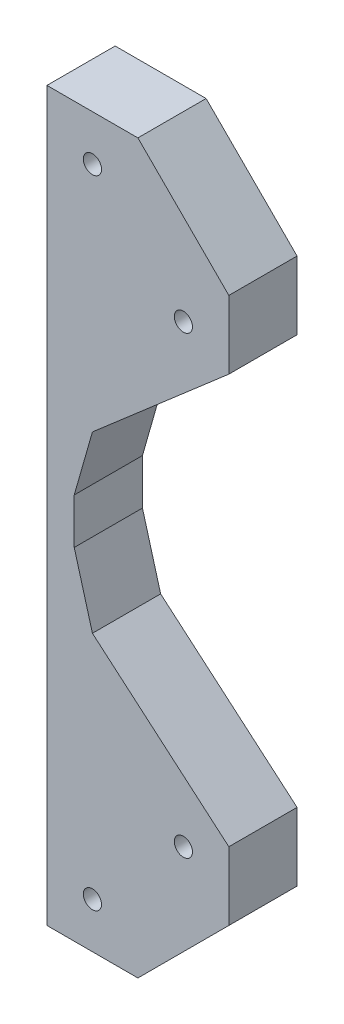
ISO-10303-21;
HEADER;
FILE_DESCRIPTION(('STEP AP214'),'2;1');
FILE_NAME('part.step','',(''),(''),'','','');
FILE_SCHEMA(('AUTOMOTIVE_DESIGN { 1 0 10303 214 1 1 1 1 }'));
ENDSEC;
DATA;
#1=APPLICATION_CONTEXT('core data for automotive mechanical design processes');
#2=APPLICATION_PROTOCOL_DEFINITION('international standard','automotive_design',2000,#1);
#3=PRODUCT_CONTEXT('',#1,'mechanical');
#4=PRODUCT('Part','Part','',(#3));
#5=PRODUCT_RELATED_PRODUCT_CATEGORY('part','',(#4));
#6=PRODUCT_DEFINITION_FORMATION('','',#4);
#7=PRODUCT_DEFINITION_CONTEXT('part definition',#1,'design');
#8=PRODUCT_DEFINITION('design','',#6,#7);
#9=PRODUCT_DEFINITION_SHAPE('','',#8);
#10=(LENGTH_UNIT() NAMED_UNIT(*) SI_UNIT(.MILLI.,.METRE.));
#11=(NAMED_UNIT(*) PLANE_ANGLE_UNIT() SI_UNIT($,.RADIAN.));
#12=(NAMED_UNIT(*) SI_UNIT($,.STERADIAN.) SOLID_ANGLE_UNIT());
#13=UNCERTAINTY_MEASURE_WITH_UNIT(LENGTH_MEASURE(1.E-05),#10,'distance_accuracy_value','');
#14=(GEOMETRIC_REPRESENTATION_CONTEXT(3) GLOBAL_UNCERTAINTY_ASSIGNED_CONTEXT((#13)) GLOBAL_UNIT_ASSIGNED_CONTEXT((#10,
#11,#12)) REPRESENTATION_CONTEXT('',''));
#15=CARTESIAN_POINT('',(0.,0.,0.));
#16=DIRECTION('',(0.,0.,1.));
#17=DIRECTION('',(1.,0.,0.));
#18=AXIS2_PLACEMENT_3D('',#15,#16,#17);
#19=CARTESIAN_POINT('',(0.,0.,15.));
#20=DIRECTION('',(0.,0.,-1.));
#21=DIRECTION('',(-1.,0.,0.));
#22=AXIS2_PLACEMENT_3D('',#19,#20,#21);
#23=PLANE('',#22);
#24=DIRECTION('',(0.,-1.,0.));
#25=VECTOR('',#24,1.);
#26=CARTESIAN_POINT('',(0.,-74.9247201383113,15.));
#27=LINE('',#26,#25);
#28=CARTESIAN_POINT('',(0.,85.0752762854099,15.));
#29=VERTEX_POINT('',#28);
#30=CARTESIAN_POINT('',(0.,-74.9247201383113,15.));
#31=VERTEX_POINT('',#30);
#32=EDGE_CURVE('E180',#29,#31,#27,.T.);
#33=ORIENTED_EDGE('',*,*,#32,.T.);
#34=DIRECTION('',(1.,0.,0.));
#35=VECTOR('',#34,1.);
#36=CARTESIAN_POINT('',(19.9999995529652,-74.9247201383113,15.));
#37=LINE('',#36,#35);
#38=CARTESIAN_POINT('',(19.9999995529652,-74.9247201383113,15.));
#39=VERTEX_POINT('',#38);
#40=EDGE_CURVE('E108',#31,#39,#37,.T.);
#41=ORIENTED_EDGE('',*,*,#40,.T.);
#42=DIRECTION('',(0.707106781186547,0.707106781186548,0.));
#43=VECTOR('',#42,1.);
#44=CARTESIAN_POINT('',(19.9999995529652,-74.9247201383113,15.));
#45=LINE('',#44,#43);
#46=CARTESIAN_POINT('',(39.9999991059303,-54.9247205853461,15.));
#47=VERTEX_POINT('',#46);
#48=EDGE_CURVE('E207',#39,#47,#45,.T.);
#49=ORIENTED_EDGE('',*,*,#48,.T.);
#50=DIRECTION('',(0.,1.,0.));
#51=VECTOR('',#50,1.);
#52=CARTESIAN_POINT('',(39.9999991059303,-39.9252750575542,15.));
#53=LINE('',#52,#51);
#54=CARTESIAN_POINT('',(39.9999991059303,-39.9252750575542,15.));
#55=VERTEX_POINT('',#54);
#56=EDGE_CURVE('E226',#47,#55,#53,.T.);
#57=ORIENTED_EDGE('',*,*,#56,.T.);
#58=DIRECTION('',(-0.760020948334788,0.649898575234851,0.));
#59=VECTOR('',#58,1.);
#60=CARTESIAN_POINT('',(9.99999977648258,-14.2720915973186,15.));
#61=LINE('',#60,#59);
#62=CARTESIAN_POINT('',(9.99999977648258,-14.2720915973186,15.));
#63=VERTEX_POINT('',#62);
#64=EDGE_CURVE('E223',#55,#63,#61,.T.);
#65=ORIENTED_EDGE('',*,*,#64,.T.);
#66=DIRECTION('',(-0.268559788040343,0.963263017170143,0.));
#67=VECTOR('',#66,1.);
#68=CARTESIAN_POINT('',(6.00000005215407,0.0749997198581306,15.));
#69=LINE('',#68,#67);
#70=CARTESIAN_POINT('',(6.00000005215407,0.0749997198581306,15.));
#71=VERTEX_POINT('',#70);
#72=EDGE_CURVE('E225',#63,#71,#69,.T.);
#73=ORIENTED_EDGE('',*,*,#72,.T.);
#74=DIRECTION('',(0.,1.,0.));
#75=VECTOR('',#74,1.);
#76=CARTESIAN_POINT('',(6.00000005215407,10.0750050842762,15.));
#77=LINE('',#76,#75);
#78=CARTESIAN_POINT('',(6.00000005215407,10.0750050842762,15.));
#79=VERTEX_POINT('',#78);
#80=EDGE_CURVE('E228',#71,#79,#77,.T.);
#81=ORIENTED_EDGE('',*,*,#80,.T.);
#82=DIRECTION('',(0.274716135210722,0.961525374108705,0.));
#83=VECTOR('',#82,1.);
#84=CARTESIAN_POINT('',(6.00000005215407,10.0750050842762,15.));
#85=LINE('',#84,#83);
#86=CARTESIAN_POINT('',(9.99999977648258,24.0752793252469,15.));
#87=VERTEX_POINT('',#86);
#88=EDGE_CURVE('E234',#79,#87,#85,.T.);
#89=ORIENTED_EDGE('',*,*,#88,.T.);
#90=DIRECTION('',(0.755689068856912,0.654930554494271,0.));
#91=VECTOR('',#90,1.);
#92=CARTESIAN_POINT('',(39.9999991059303,50.0752798616888,15.));
#93=LINE('',#92,#91);
#94=CARTESIAN_POINT('',(39.9999991059303,50.0752798616888,15.));
#95=VERTEX_POINT('',#94);
#96=EDGE_CURVE('E139',#87,#95,#93,.T.);
#97=ORIENTED_EDGE('',*,*,#96,.T.);
#98=DIRECTION('',(0.,1.,0.));
#99=VECTOR('',#98,1.);
#100=CARTESIAN_POINT('',(39.9999991059303,65.075280457735,15.));
#101=LINE('',#100,#99);
#102=CARTESIAN_POINT('',(39.9999991059303,65.075280457735,15.));
#103=VERTEX_POINT('',#102);
#104=EDGE_CURVE('E133',#95,#103,#101,.T.);
#105=ORIENTED_EDGE('',*,*,#104,.T.);
#106=DIRECTION('',(-0.707106847041003,0.707106715332086,0.));
#107=VECTOR('',#106,1.);
#108=CARTESIAN_POINT('',(19.9999995529652,85.0752762854099,15.));
#109=LINE('',#108,#107);
#110=CARTESIAN_POINT('',(19.9999995529652,85.0752762854099,15.));
#111=VERTEX_POINT('',#110);
#112=EDGE_CURVE('E137',#103,#111,#109,.T.);
#113=ORIENTED_EDGE('',*,*,#112,.T.);
#114=DIRECTION('',(-1.,0.,0.));
#115=VECTOR('',#114,1.);
#116=CARTESIAN_POINT('',(0.,85.0752762854099,15.));
#117=LINE('',#116,#115);
#118=EDGE_CURVE('E53',#111,#29,#117,.T.);
#119=ORIENTED_EDGE('',*,*,#118,.T.);
#120=EDGE_LOOP('',(#33,#41,#49,#57,#65,#73,#81,#89,#97,#105,#113,#119));
#121=FACE_BOUND('',#120,.T.);
#122=CARTESIAN_POINT('',(29.9999993294477,-44.9247189462184,15.));
#123=DIRECTION('',(0.,0.,1.));
#124=DIRECTION('',(1.,0.,0.));
#125=AXIS2_PLACEMENT_3D('',#122,#123,#124);
#126=CIRCLE('',#125,2.00000032782555);
#127=CARTESIAN_POINT('',(31.9999996572733,-44.9247189462184,15.));
#128=VERTEX_POINT('',#127);
#129=EDGE_CURVE('E161',#128,#128,#126,.T.);
#130=ORIENTED_EDGE('',*,*,#129,.F.);
#131=EDGE_LOOP('',(#130));
#132=FACE_BOUND('',#131,.T.);
#133=CARTESIAN_POINT('',(9.99999977648258,-64.9247198961675,15.));
#134=DIRECTION('',(0.,0.,1.));
#135=DIRECTION('',(1.,0.,0.));
#136=AXIS2_PLACEMENT_3D('',#133,#134,#135);
#137=CIRCLE('',#136,1.99999986216425);
#138=CARTESIAN_POINT('',(11.9999996386468,-64.9247198961675,15.));
#139=VERTEX_POINT('',#138);
#140=EDGE_CURVE('E298',#139,#139,#137,.T.);
#141=ORIENTED_EDGE('',*,*,#140,.F.);
#142=EDGE_LOOP('',(#141));
#143=FACE_BOUND('',#142,.T.);
#144=CARTESIAN_POINT('',(9.99999977648258,75.0752783715725,15.));
#145=DIRECTION('',(0.,0.,1.));
#146=DIRECTION('',(1.,0.,0.));
#147=AXIS2_PLACEMENT_3D('',#144,#145,#146);
#148=CIRCLE('',#147,2.00000032783944);
#149=CARTESIAN_POINT('',(12.000000104322,75.0752783715725,15.));
#150=VERTEX_POINT('',#149);
#151=EDGE_CURVE('E292',#150,#150,#148,.T.);
#152=ORIENTED_EDGE('',*,*,#151,.F.);
#153=EDGE_LOOP('',(#152));
#154=FACE_BOUND('',#153,.T.);
#155=CARTESIAN_POINT('',(29.9999993294477,55.0752825438977,15.));
#156=DIRECTION('',(0.,0.,1.));
#157=DIRECTION('',(1.,0.,0.));
#158=AXIS2_PLACEMENT_3D('',#155,#156,#157);
#159=CIRCLE('',#158,1.99999660253528);
#160=CARTESIAN_POINT('',(31.999995931983,55.0752825438977,15.));
#161=VERTEX_POINT('',#160);
#162=EDGE_CURVE('E283',#161,#161,#159,.T.);
#163=ORIENTED_EDGE('',*,*,#162,.F.);
#164=EDGE_LOOP('',(#163));
#165=FACE_BOUND('',#164,.T.);
#166=ADVANCED_FACE('F36',(#121,#132,#143,#154,#165),#23,.F.);
#167=CARTESIAN_POINT('',(0.,0.,0.));
#168=DIRECTION('',(0.,0.,-1.));
#169=DIRECTION('',(-1.,0.,0.));
#170=AXIS2_PLACEMENT_3D('',#167,#168,#169);
#171=PLANE('',#170);
#172=CARTESIAN_POINT('',(9.99999977648258,75.0752783715725,0.));
#173=DIRECTION('',(0.,0.,1.));
#174=DIRECTION('',(1.,0.,0.));
#175=AXIS2_PLACEMENT_3D('',#172,#173,#174);
#176=CIRCLE('',#175,2.00000032783944);
#177=CARTESIAN_POINT('',(12.000000104322,75.0752783715725,0.));
#178=VERTEX_POINT('',#177);
#179=EDGE_CURVE('E289',#178,#178,#176,.T.);
#180=ORIENTED_EDGE('',*,*,#179,.T.);
#181=EDGE_LOOP('',(#180));
#182=FACE_BOUND('',#181,.T.);
#183=CARTESIAN_POINT('',(29.9999993294477,-44.9247189462184,0.));
#184=DIRECTION('',(0.,0.,1.));
#185=DIRECTION('',(1.,0.,0.));
#186=AXIS2_PLACEMENT_3D('',#183,#184,#185);
#187=CIRCLE('',#186,2.00000032782555);
#188=CARTESIAN_POINT('',(31.9999996572733,-44.9247189462184,0.));
#189=VERTEX_POINT('',#188);
#190=EDGE_CURVE('E301',#189,#189,#187,.T.);
#191=ORIENTED_EDGE('',*,*,#190,.T.);
#192=EDGE_LOOP('',(#191));
#193=FACE_BOUND('',#192,.T.);
#194=DIRECTION('',(0.,-1.,0.));
#195=VECTOR('',#194,1.);
#196=CARTESIAN_POINT('',(0.,-74.9247201383113,0.));
#197=LINE('',#196,#195);
#198=CARTESIAN_POINT('',(0.,85.0752762854099,0.));
#199=VERTEX_POINT('',#198);
#200=CARTESIAN_POINT('',(0.,-74.9247201383113,0.));
#201=VERTEX_POINT('',#200);
#202=EDGE_CURVE('E157',#199,#201,#197,.T.);
#203=ORIENTED_EDGE('',*,*,#202,.F.);
#204=DIRECTION('',(-1.,0.,0.));
#205=VECTOR('',#204,1.);
#206=CARTESIAN_POINT('',(0.,85.0752762854099,0.));
#207=LINE('',#206,#205);
#208=CARTESIAN_POINT('',(19.9999995529652,85.0752762854099,0.));
#209=VERTEX_POINT('',#208);
#210=EDGE_CURVE('E100',#209,#199,#207,.T.);
#211=ORIENTED_EDGE('',*,*,#210,.F.);
#212=DIRECTION('',(-0.707106847041003,0.707106715332086,0.));
#213=VECTOR('',#212,1.);
#214=CARTESIAN_POINT('',(19.9999995529652,85.0752762854099,0.));
#215=LINE('',#214,#213);
#216=CARTESIAN_POINT('',(39.9999991059303,65.075280457735,0.));
#217=VERTEX_POINT('',#216);
#218=EDGE_CURVE('E94',#217,#209,#215,.T.);
#219=ORIENTED_EDGE('',*,*,#218,.F.);
#220=DIRECTION('',(0.,1.,0.));
#221=VECTOR('',#220,1.);
#222=CARTESIAN_POINT('',(39.9999991059303,65.075280457735,0.));
#223=LINE('',#222,#221);
#224=CARTESIAN_POINT('',(39.9999991059303,50.0752798616888,0.));
#225=VERTEX_POINT('',#224);
#226=EDGE_CURVE('E147',#225,#217,#223,.T.);
#227=ORIENTED_EDGE('',*,*,#226,.F.);
#228=DIRECTION('',(0.755689068856912,0.654930554494271,0.));
#229=VECTOR('',#228,1.);
#230=CARTESIAN_POINT('',(39.9999991059303,50.0752798616888,0.));
#231=LINE('',#230,#229);
#232=CARTESIAN_POINT('',(9.99999977648258,24.0752793252469,0.));
#233=VERTEX_POINT('',#232);
#234=EDGE_CURVE('E175',#233,#225,#231,.T.);
#235=ORIENTED_EDGE('',*,*,#234,.F.);
#236=DIRECTION('',(0.274716135210722,0.961525374108705,0.));
#237=VECTOR('',#236,1.);
#238=CARTESIAN_POINT('',(6.00000005215407,10.0750050842762,0.));
#239=LINE('',#238,#237);
#240=CARTESIAN_POINT('',(6.00000005215407,10.0750050842762,0.));
#241=VERTEX_POINT('',#240);
#242=EDGE_CURVE('E173',#241,#233,#239,.T.);
#243=ORIENTED_EDGE('',*,*,#242,.F.);
#244=DIRECTION('',(0.,1.,0.));
#245=VECTOR('',#244,1.);
#246=CARTESIAN_POINT('',(6.00000005215407,10.0750050842762,0.));
#247=LINE('',#246,#245);
#248=CARTESIAN_POINT('',(6.00000005215407,0.0749997198581306,0.));
#249=VERTEX_POINT('',#248);
#250=EDGE_CURVE('E171',#249,#241,#247,.T.);
#251=ORIENTED_EDGE('',*,*,#250,.F.);
#252=DIRECTION('',(-0.268559788040343,0.963263017170143,0.));
#253=VECTOR('',#252,1.);
#254=CARTESIAN_POINT('',(6.00000005215407,0.0749997198581306,0.));
#255=LINE('',#254,#253);
#256=CARTESIAN_POINT('',(9.99999977648258,-14.2720915973186,0.));
#257=VERTEX_POINT('',#256);
#258=EDGE_CURVE('E169',#257,#249,#255,.T.);
#259=ORIENTED_EDGE('',*,*,#258,.F.);
#260=DIRECTION('',(-0.760020948334788,0.649898575234851,0.));
#261=VECTOR('',#260,1.);
#262=CARTESIAN_POINT('',(9.99999977648258,-14.2720915973186,0.));
#263=LINE('',#262,#261);
#264=CARTESIAN_POINT('',(39.9999991059303,-39.9252750575542,0.));
#265=VERTEX_POINT('',#264);
#266=EDGE_CURVE('E167',#265,#257,#263,.T.);
#267=ORIENTED_EDGE('',*,*,#266,.F.);
#268=DIRECTION('',(0.,1.,0.));
#269=VECTOR('',#268,1.);
#270=CARTESIAN_POINT('',(39.9999991059303,-39.9252750575542,0.));
#271=LINE('',#270,#269);
#272=CARTESIAN_POINT('',(39.9999991059303,-54.9247205853461,0.));
#273=VERTEX_POINT('',#272);
#274=EDGE_CURVE('E165',#273,#265,#271,.T.);
#275=ORIENTED_EDGE('',*,*,#274,.F.);
#276=DIRECTION('',(0.707106781186547,0.707106781186548,0.));
#277=VECTOR('',#276,1.);
#278=CARTESIAN_POINT('',(19.9999995529652,-74.9247201383113,0.));
#279=LINE('',#278,#277);
#280=CARTESIAN_POINT('',(19.9999995529652,-74.9247201383113,0.));
#281=VERTEX_POINT('',#280);
#282=EDGE_CURVE('E163',#281,#273,#279,.T.);
#283=ORIENTED_EDGE('',*,*,#282,.F.);
#284=DIRECTION('',(1.,0.,0.));
#285=VECTOR('',#284,1.);
#286=CARTESIAN_POINT('',(19.9999995529652,-74.9247201383113,0.));
#287=LINE('',#286,#285);
#288=EDGE_CURVE('E160',#201,#281,#287,.T.);
#289=ORIENTED_EDGE('',*,*,#288,.F.);
#290=EDGE_LOOP('',(#203,#211,#219,#227,#235,#243,#251,#259,#267,#275,#283,#289));
#291=FACE_BOUND('',#290,.T.);
#292=CARTESIAN_POINT('',(9.99999977648258,-64.9247198961675,0.));
#293=DIRECTION('',(0.,0.,1.));
#294=DIRECTION('',(1.,0.,0.));
#295=AXIS2_PLACEMENT_3D('',#292,#293,#294);
#296=CIRCLE('',#295,1.99999986216425);
#297=CARTESIAN_POINT('',(11.9999996386468,-64.9247198961675,0.));
#298=VERTEX_POINT('',#297);
#299=EDGE_CURVE('E295',#298,#298,#296,.T.);
#300=ORIENTED_EDGE('',*,*,#299,.T.);
#301=EDGE_LOOP('',(#300));
#302=FACE_BOUND('',#301,.T.);
#303=CARTESIAN_POINT('',(29.9999993294477,55.0752825438977,0.));
#304=DIRECTION('',(0.,0.,1.));
#305=DIRECTION('',(1.,0.,0.));
#306=AXIS2_PLACEMENT_3D('',#303,#304,#305);
#307=CIRCLE('',#306,1.99999660253528);
#308=CARTESIAN_POINT('',(31.999995931983,55.0752825438977,0.));
#309=VERTEX_POINT('',#308);
#310=EDGE_CURVE('E286',#309,#309,#307,.T.);
#311=ORIENTED_EDGE('',*,*,#310,.T.);
#312=EDGE_LOOP('',(#311));
#313=FACE_BOUND('',#312,.T.);
#314=ADVANCED_FACE('F211',(#182,#193,#291,#302,#313),#171,.T.);
#315=CARTESIAN_POINT('',(0.,-74.9247201383113,15.));
#316=DIRECTION('',(1.,0.,0.));
#317=DIRECTION('',(0.,0.,-1.));
#318=AXIS2_PLACEMENT_3D('',#315,#316,#317);
#319=PLANE('',#318);
#320=ORIENTED_EDGE('',*,*,#202,.T.);
#321=DIRECTION('',(0.,0.,-1.));
#322=VECTOR('',#321,1.);
#323=CARTESIAN_POINT('',(0.,-74.9247201383113,15.));
#324=LINE('',#323,#322);
#325=EDGE_CURVE('E11',#31,#201,#324,.T.);
#326=ORIENTED_EDGE('',*,*,#325,.F.);
#327=ORIENTED_EDGE('',*,*,#32,.F.);
#328=DIRECTION('',(0.,0.,-1.));
#329=VECTOR('',#328,1.);
#330=CARTESIAN_POINT('',(0.,85.0752762854099,15.));
#331=LINE('',#330,#329);
#332=EDGE_CURVE('E153',#29,#199,#331,.T.);
#333=ORIENTED_EDGE('',*,*,#332,.T.);
#334=EDGE_LOOP('',(#320,#326,#327,#333));
#335=FACE_BOUND('',#334,.T.);
#336=ADVANCED_FACE('F38',(#335),#319,.F.);
#337=CARTESIAN_POINT('',(19.9999995529652,-74.9247201383113,15.));
#338=DIRECTION('',(0.,1.,0.));
#339=DIRECTION('',(0.,0.,1.));
#340=AXIS2_PLACEMENT_3D('',#337,#338,#339);
#341=PLANE('',#340);
#342=ORIENTED_EDGE('',*,*,#288,.T.);
#343=DIRECTION('',(0.,0.,-1.));
#344=VECTOR('',#343,1.);
#345=CARTESIAN_POINT('',(19.9999995529652,-74.9247201383113,15.));
#346=LINE('',#345,#344);
#347=EDGE_CURVE('E45',#39,#281,#346,.T.);
#348=ORIENTED_EDGE('',*,*,#347,.F.);
#349=ORIENTED_EDGE('',*,*,#40,.F.);
#350=ORIENTED_EDGE('',*,*,#325,.T.);
#351=EDGE_LOOP('',(#342,#348,#349,#350));
#352=FACE_BOUND('',#351,.T.);
#353=ADVANCED_FACE('F413',(#352),#341,.F.);
#354=CARTESIAN_POINT('',(19.9999995529652,-74.9247201383113,15.));
#355=DIRECTION('',(-0.707106781186548,0.707106781186547,0.));
#356=DIRECTION('',(-0.707106781186547,-0.707106781186548,0.));
#357=AXIS2_PLACEMENT_3D('',#354,#355,#356);
#358=PLANE('',#357);
#359=ORIENTED_EDGE('',*,*,#282,.T.);
#360=DIRECTION('',(0.,0.,-1.));
#361=VECTOR('',#360,1.);
#362=CARTESIAN_POINT('',(39.9999991059303,-54.9247205853461,15.));
#363=LINE('',#362,#361);
#364=EDGE_CURVE('E199',#47,#273,#363,.T.);
#365=ORIENTED_EDGE('',*,*,#364,.F.);
#366=ORIENTED_EDGE('',*,*,#48,.F.);
#367=ORIENTED_EDGE('',*,*,#347,.T.);
#368=EDGE_LOOP('',(#359,#365,#366,#367));
#369=FACE_BOUND('',#368,.T.);
#370=ADVANCED_FACE('F205',(#369),#358,.F.);
#371=CARTESIAN_POINT('',(39.9999991059303,-39.9252750575542,15.));
#372=DIRECTION('',(-1.,0.,0.));
#373=DIRECTION('',(0.,0.,1.));
#374=AXIS2_PLACEMENT_3D('',#371,#372,#373);
#375=PLANE('',#374);
#376=ORIENTED_EDGE('',*,*,#274,.T.);
#377=DIRECTION('',(0.,0.,-1.));
#378=VECTOR('',#377,1.);
#379=CARTESIAN_POINT('',(39.9999991059303,-39.9252750575542,15.));
#380=LINE('',#379,#378);
#381=EDGE_CURVE('E196',#55,#265,#380,.T.);
#382=ORIENTED_EDGE('',*,*,#381,.F.);
#383=ORIENTED_EDGE('',*,*,#56,.F.);
#384=ORIENTED_EDGE('',*,*,#364,.T.);
#385=EDGE_LOOP('',(#376,#382,#383,#384));
#386=FACE_BOUND('',#385,.T.);
#387=ADVANCED_FACE('F217',(#386),#375,.F.);
#388=CARTESIAN_POINT('',(9.99999977648258,-14.2720915973186,15.));
#389=DIRECTION('',(-0.649898575234851,-0.760020948334788,0.));
#390=DIRECTION('',(0.760020948334788,-0.649898575234851,0.));
#391=AXIS2_PLACEMENT_3D('',#388,#389,#390);
#392=PLANE('',#391);
#393=ORIENTED_EDGE('',*,*,#266,.T.);
#394=DIRECTION('',(0.,0.,-1.));
#395=VECTOR('',#394,1.);
#396=CARTESIAN_POINT('',(9.99999977648258,-14.2720915973186,15.));
#397=LINE('',#396,#395);
#398=EDGE_CURVE('E193',#63,#257,#397,.T.);
#399=ORIENTED_EDGE('',*,*,#398,.F.);
#400=ORIENTED_EDGE('',*,*,#64,.F.);
#401=ORIENTED_EDGE('',*,*,#381,.T.);
#402=EDGE_LOOP('',(#393,#399,#400,#401));
#403=FACE_BOUND('',#402,.T.);
#404=ADVANCED_FACE('F221',(#403),#392,.F.);
#405=CARTESIAN_POINT('',(6.00000005215407,0.0749997198581306,15.));
#406=DIRECTION('',(-0.963263017170142,-0.268559788040343,0.));
#407=DIRECTION('',(0.268559788040343,-0.963263017170143,0.));
#408=AXIS2_PLACEMENT_3D('',#405,#406,#407);
#409=PLANE('',#408);
#410=ORIENTED_EDGE('',*,*,#258,.T.);
#411=DIRECTION('',(0.,0.,-1.));
#412=VECTOR('',#411,1.);
#413=CARTESIAN_POINT('',(6.00000005215407,0.0749997198581306,15.));
#414=LINE('',#413,#412);
#415=EDGE_CURVE('E190',#71,#249,#414,.T.);
#416=ORIENTED_EDGE('',*,*,#415,.F.);
#417=ORIENTED_EDGE('',*,*,#72,.F.);
#418=ORIENTED_EDGE('',*,*,#398,.T.);
#419=EDGE_LOOP('',(#410,#416,#417,#418));
#420=FACE_BOUND('',#419,.T.);
#421=ADVANCED_FACE('F378',(#420),#409,.F.);
#422=CARTESIAN_POINT('',(6.00000005215407,10.0750050842762,15.));
#423=DIRECTION('',(-1.,0.,0.));
#424=DIRECTION('',(0.,0.,1.));
#425=AXIS2_PLACEMENT_3D('',#422,#423,#424);
#426=PLANE('',#425);
#427=ORIENTED_EDGE('',*,*,#250,.T.);
#428=DIRECTION('',(0.,0.,-1.));
#429=VECTOR('',#428,1.);
#430=CARTESIAN_POINT('',(6.00000005215407,10.0750050842762,15.));
#431=LINE('',#430,#429);
#432=EDGE_CURVE('E187',#79,#241,#431,.T.);
#433=ORIENTED_EDGE('',*,*,#432,.F.);
#434=ORIENTED_EDGE('',*,*,#80,.F.);
#435=ORIENTED_EDGE('',*,*,#415,.T.);
#436=EDGE_LOOP('',(#427,#433,#434,#435));
#437=FACE_BOUND('',#436,.T.);
#438=ADVANCED_FACE('F369',(#437),#426,.F.);
#439=CARTESIAN_POINT('',(6.00000005215407,10.0750050842762,15.));
#440=DIRECTION('',(-0.961525374108705,0.274716135210721,0.));
#441=DIRECTION('',(-0.274716135210722,-0.961525374108705,0.));
#442=AXIS2_PLACEMENT_3D('',#439,#440,#441);
#443=PLANE('',#442);
#444=ORIENTED_EDGE('',*,*,#242,.T.);
#445=DIRECTION('',(0.,0.,-1.));
#446=VECTOR('',#445,1.);
#447=CARTESIAN_POINT('',(9.99999977648258,24.0752793252469,15.));
#448=LINE('',#447,#446);
#449=EDGE_CURVE('E184',#87,#233,#448,.T.);
#450=ORIENTED_EDGE('',*,*,#449,.F.);
#451=ORIENTED_EDGE('',*,*,#88,.F.);
#452=ORIENTED_EDGE('',*,*,#432,.T.);
#453=EDGE_LOOP('',(#444,#450,#451,#452));
#454=FACE_BOUND('',#453,.T.);
#455=ADVANCED_FACE('F240',(#454),#443,.F.);
#456=CARTESIAN_POINT('',(39.9999991059303,50.0752798616888,15.));
#457=DIRECTION('',(-0.654930554494272,0.755689068856912,0.));
#458=DIRECTION('',(-0.755689068856912,-0.654930554494272,0.));
#459=AXIS2_PLACEMENT_3D('',#456,#457,#458);
#460=PLANE('',#459);
#461=ORIENTED_EDGE('',*,*,#234,.T.);
#462=DIRECTION('',(0.,0.,-1.));
#463=VECTOR('',#462,1.);
#464=CARTESIAN_POINT('',(39.9999991059303,50.0752798616888,15.));
#465=LINE('',#464,#463);
#466=EDGE_CURVE('E148',#95,#225,#465,.T.);
#467=ORIENTED_EDGE('',*,*,#466,.F.);
#468=ORIENTED_EDGE('',*,*,#96,.F.);
#469=ORIENTED_EDGE('',*,*,#449,.T.);
#470=EDGE_LOOP('',(#461,#467,#468,#469));
#471=FACE_BOUND('',#470,.T.);
#472=ADVANCED_FACE('F244',(#471),#460,.F.);
#473=CARTESIAN_POINT('',(39.9999991059303,65.075280457735,15.));
#474=DIRECTION('',(-1.,0.,0.));
#475=DIRECTION('',(0.,0.,1.));
#476=AXIS2_PLACEMENT_3D('',#473,#474,#475);
#477=PLANE('',#476);
#478=ORIENTED_EDGE('',*,*,#226,.T.);
#479=DIRECTION('',(0.,0.,-1.));
#480=VECTOR('',#479,1.);
#481=CARTESIAN_POINT('',(39.9999991059303,65.075280457735,15.));
#482=LINE('',#481,#480);
#483=EDGE_CURVE('E144',#103,#217,#482,.T.);
#484=ORIENTED_EDGE('',*,*,#483,.F.);
#485=ORIENTED_EDGE('',*,*,#104,.F.);
#486=ORIENTED_EDGE('',*,*,#466,.T.);
#487=EDGE_LOOP('',(#478,#484,#485,#486));
#488=FACE_BOUND('',#487,.T.);
#489=ADVANCED_FACE('F145',(#488),#477,.F.);
#490=CARTESIAN_POINT('',(19.9999995529652,85.0752762854099,15.));
#491=DIRECTION('',(-0.707106715332086,-0.707106847041003,0.));
#492=DIRECTION('',(0.707106847041003,-0.707106715332086,0.));
#493=AXIS2_PLACEMENT_3D('',#490,#491,#492);
#494=PLANE('',#493);
#495=ORIENTED_EDGE('',*,*,#218,.T.);
#496=DIRECTION('',(0.,0.,-1.));
#497=VECTOR('',#496,1.);
#498=CARTESIAN_POINT('',(19.9999995529652,85.0752762854099,15.));
#499=LINE('',#498,#497);
#500=EDGE_CURVE('E149',#111,#209,#499,.T.);
#501=ORIENTED_EDGE('',*,*,#500,.F.);
#502=ORIENTED_EDGE('',*,*,#112,.F.);
#503=ORIENTED_EDGE('',*,*,#483,.T.);
#504=EDGE_LOOP('',(#495,#501,#502,#503));
#505=FACE_BOUND('',#504,.T.);
#506=ADVANCED_FACE('F151',(#505),#494,.F.);
#507=CARTESIAN_POINT('',(0.,85.0752762854099,15.));
#508=DIRECTION('',(0.,-1.,0.));
#509=DIRECTION('',(0.,0.,-1.));
#510=AXIS2_PLACEMENT_3D('',#507,#508,#509);
#511=PLANE('',#510);
#512=ORIENTED_EDGE('',*,*,#210,.T.);
#513=ORIENTED_EDGE('',*,*,#332,.F.);
#514=ORIENTED_EDGE('',*,*,#118,.F.);
#515=ORIENTED_EDGE('',*,*,#500,.T.);
#516=EDGE_LOOP('',(#512,#513,#514,#515));
#517=FACE_BOUND('',#516,.T.);
#518=ADVANCED_FACE('F248',(#517),#511,.F.);
#519=CARTESIAN_POINT('',(29.9999993294477,-44.9247189462184,15.));
#520=DIRECTION('',(0.,0.,-1.));
#521=DIRECTION('',(-1.,0.,0.));
#522=AXIS2_PLACEMENT_3D('',#519,#520,#521);
#523=CYLINDRICAL_SURFACE('',#522,2.00000032782555);
#524=ORIENTED_EDGE('',*,*,#129,.T.);
#525=EDGE_LOOP('',(#524));
#526=FACE_BOUND('',#525,.T.);
#527=ORIENTED_EDGE('',*,*,#190,.F.);
#528=EDGE_LOOP('',(#527));
#529=FACE_BOUND('',#528,.T.);
#530=ADVANCED_FACE('F250',(#526,#529),#523,.F.);
#531=CARTESIAN_POINT('',(9.99999977648258,-64.9247198961675,15.));
#532=DIRECTION('',(0.,0.,-1.));
#533=DIRECTION('',(-1.,0.,0.));
#534=AXIS2_PLACEMENT_3D('',#531,#532,#533);
#535=CYLINDRICAL_SURFACE('',#534,1.99999986216425);
#536=ORIENTED_EDGE('',*,*,#140,.T.);
#537=EDGE_LOOP('',(#536));
#538=FACE_BOUND('',#537,.T.);
#539=ORIENTED_EDGE('',*,*,#299,.F.);
#540=EDGE_LOOP('',(#539));
#541=FACE_BOUND('',#540,.T.);
#542=ADVANCED_FACE('F256',(#538,#541),#535,.F.);
#543=CARTESIAN_POINT('',(9.99999977648258,75.0752783715725,15.));
#544=DIRECTION('',(0.,0.,-1.));
#545=DIRECTION('',(-1.,0.,0.));
#546=AXIS2_PLACEMENT_3D('',#543,#544,#545);
#547=CYLINDRICAL_SURFACE('',#546,2.00000032783944);
#548=ORIENTED_EDGE('',*,*,#151,.T.);
#549=EDGE_LOOP('',(#548));
#550=FACE_BOUND('',#549,.T.);
#551=ORIENTED_EDGE('',*,*,#179,.F.);
#552=EDGE_LOOP('',(#551));
#553=FACE_BOUND('',#552,.T.);
#554=ADVANCED_FACE('F270',(#550,#553),#547,.F.);
#555=CARTESIAN_POINT('',(29.9999993294477,55.0752825438977,15.));
#556=DIRECTION('',(0.,0.,-1.));
#557=DIRECTION('',(-1.,0.,0.));
#558=AXIS2_PLACEMENT_3D('',#555,#556,#557);
#559=CYLINDRICAL_SURFACE('',#558,1.99999660253528);
#560=ORIENTED_EDGE('',*,*,#162,.T.);
#561=EDGE_LOOP('',(#560));
#562=FACE_BOUND('',#561,.T.);
#563=ORIENTED_EDGE('',*,*,#310,.F.);
#564=EDGE_LOOP('',(#563));
#565=FACE_BOUND('',#564,.T.);
#566=ADVANCED_FACE('F274',(#562,#565),#559,.F.);
#567=CLOSED_SHELL('',(#166,#314,#336,#353,#370,#387,#404,#421,#438,#455,#472,#489,#506,#518,
#530,#542,#554,#566));
#568=MANIFOLD_SOLID_BREP('B2',#567);
#569=ADVANCED_BREP_SHAPE_REPRESENTATION('',(#18,#568),#14);
#570=SHAPE_DEFINITION_REPRESENTATION(#9,#569);
ENDSEC;
END-ISO-10303-21;
